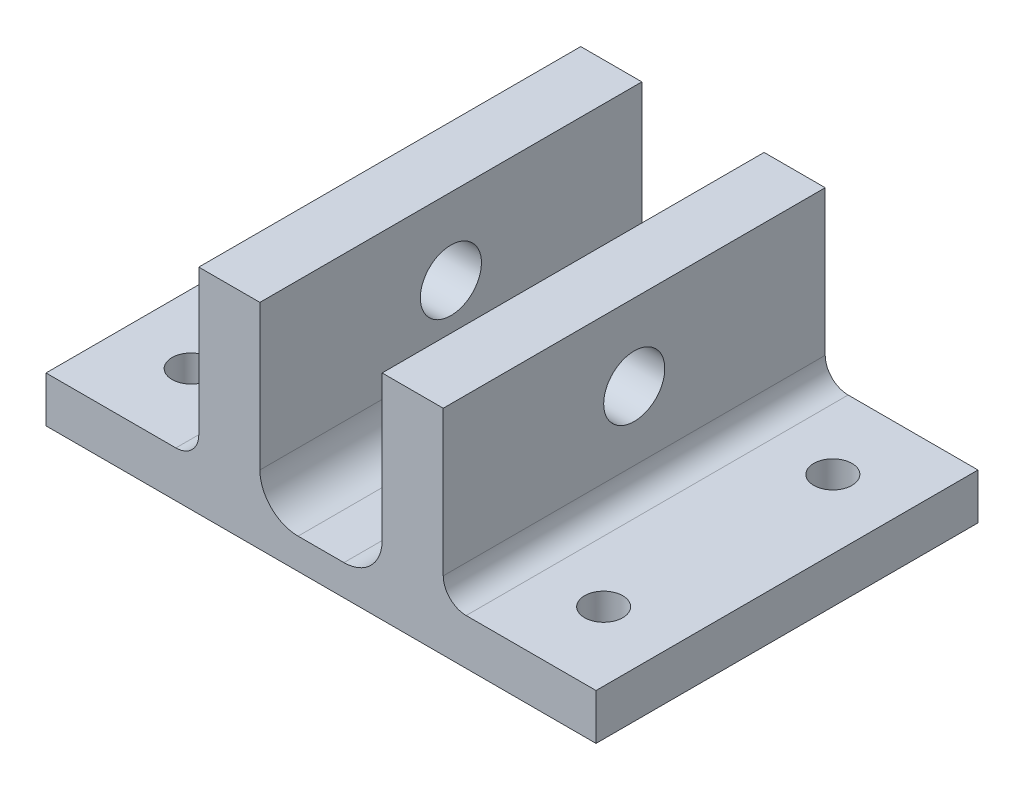
ISO-10303-21;
HEADER;
FILE_DESCRIPTION(('STEP AP214'),'2;1');
FILE_NAME('part.step','',(''),(''),'','','');
FILE_SCHEMA(('AUTOMOTIVE_DESIGN { 1 0 10303 214 1 1 1 1 }'));
ENDSEC;
DATA;
#1=APPLICATION_CONTEXT('core data for automotive mechanical design processes');
#2=APPLICATION_PROTOCOL_DEFINITION('international standard','automotive_design',2000,#1);
#3=PRODUCT_CONTEXT('',#1,'mechanical');
#4=PRODUCT('Part','Part','',(#3));
#5=PRODUCT_RELATED_PRODUCT_CATEGORY('part','',(#4));
#6=PRODUCT_DEFINITION_FORMATION('','',#4);
#7=PRODUCT_DEFINITION_CONTEXT('part definition',#1,'design');
#8=PRODUCT_DEFINITION('design','',#6,#7);
#9=PRODUCT_DEFINITION_SHAPE('','',#8);
#10=(LENGTH_UNIT() NAMED_UNIT(*) SI_UNIT(.MILLI.,.METRE.));
#11=(NAMED_UNIT(*) PLANE_ANGLE_UNIT() SI_UNIT($,.RADIAN.));
#12=(NAMED_UNIT(*) SI_UNIT($,.STERADIAN.) SOLID_ANGLE_UNIT());
#13=UNCERTAINTY_MEASURE_WITH_UNIT(LENGTH_MEASURE(1.E-05),#10,'distance_accuracy_value','');
#14=(GEOMETRIC_REPRESENTATION_CONTEXT(3) GLOBAL_UNCERTAINTY_ASSIGNED_CONTEXT((#13)) GLOBAL_UNIT_ASSIGNED_CONTEXT((#10,
#11,#12)) REPRESENTATION_CONTEXT('',''));
#15=CARTESIAN_POINT('',(0.,0.,0.));
#16=DIRECTION('',(0.,0.,1.));
#17=DIRECTION('',(1.,0.,0.));
#18=AXIS2_PLACEMENT_3D('',#15,#16,#17);
#19=CARTESIAN_POINT('',(-32.,0.,25.));
#20=DIRECTION('',(0.,1.,0.));
#21=DIRECTION('',(-1.,0.,0.));
#22=AXIS2_PLACEMENT_3D('',#19,#20,#21);
#23=PLANE('',#22);
#24=CARTESIAN_POINT('',(-43.,0.,15.));
#25=DIRECTION('',(0.,1.,0.));
#26=DIRECTION('',(1.,0.,0.));
#27=AXIS2_PLACEMENT_3D('',#24,#25,#26);
#28=CIRCLE('',#27,2.5);
#29=CARTESIAN_POINT('',(-40.5,0.,15.));
#30=VERTEX_POINT('',#29);
#31=EDGE_CURVE('E434',#30,#30,#28,.T.);
#32=ORIENTED_EDGE('',*,*,#31,.T.);
#33=EDGE_LOOP('',(#32));
#34=FACE_BOUND('',#33,.T.);
#35=CARTESIAN_POINT('',(11.,0.,15.));
#36=DIRECTION('',(0.,1.,0.));
#37=DIRECTION('',(-1.,0.,0.));
#38=AXIS2_PLACEMENT_3D('',#35,#36,#37);
#39=CIRCLE('',#38,2.5);
#40=CARTESIAN_POINT('',(8.50000000000001,0.,15.));
#41=VERTEX_POINT('',#40);
#42=EDGE_CURVE('E435',#41,#41,#39,.T.);
#43=ORIENTED_EDGE('',*,*,#42,.T.);
#44=EDGE_LOOP('',(#43));
#45=FACE_BOUND('',#44,.T.);
#46=CARTESIAN_POINT('',(11.,0.,-15.));
#47=DIRECTION('',(0.,1.,0.));
#48=DIRECTION('',(1.,0.,0.));
#49=AXIS2_PLACEMENT_3D('',#46,#47,#48);
#50=CIRCLE('',#49,2.5);
#51=CARTESIAN_POINT('',(13.5,0.,-15.));
#52=VERTEX_POINT('',#51);
#53=EDGE_CURVE('E438',#52,#52,#50,.T.);
#54=ORIENTED_EDGE('',*,*,#53,.T.);
#55=EDGE_LOOP('',(#54));
#56=FACE_BOUND('',#55,.T.);
#57=CARTESIAN_POINT('',(-43.,0.,-15.));
#58=DIRECTION('',(0.,1.,0.));
#59=DIRECTION('',(-1.,0.,0.));
#60=AXIS2_PLACEMENT_3D('',#57,#58,#59);
#61=CIRCLE('',#60,2.5);
#62=CARTESIAN_POINT('',(-45.5,0.,-15.));
#63=VERTEX_POINT('',#62);
#64=EDGE_CURVE('E287',#63,#63,#61,.T.);
#65=ORIENTED_EDGE('',*,*,#64,.T.);
#66=EDGE_LOOP('',(#65));
#67=FACE_BOUND('',#66,.T.);
#68=DIRECTION('',(1.,0.,0.));
#69=VECTOR('',#68,1.);
#70=CARTESIAN_POINT('',(-32.,0.,-25.));
#71=LINE('',#70,#69);
#72=CARTESIAN_POINT('',(-52.,0.,-25.));
#73=VERTEX_POINT('',#72);
#74=CARTESIAN_POINT('',(20.,0.,-25.));
#75=VERTEX_POINT('',#74);
#76=EDGE_CURVE('E176',#73,#75,#71,.T.);
#77=ORIENTED_EDGE('',*,*,#76,.T.);
#78=DIRECTION('',(0.,0.,-1.));
#79=VECTOR('',#78,1.);
#80=CARTESIAN_POINT('',(20.,0.,25.));
#81=LINE('',#80,#79);
#82=CARTESIAN_POINT('',(20.,0.,25.));
#83=VERTEX_POINT('',#82);
#84=EDGE_CURVE('E174',#83,#75,#81,.T.);
#85=ORIENTED_EDGE('',*,*,#84,.F.);
#86=DIRECTION('',(-1.,0.,0.));
#87=VECTOR('',#86,1.);
#88=CARTESIAN_POINT('',(-32.,0.,25.));
#89=LINE('',#88,#87);
#90=CARTESIAN_POINT('',(-52.,0.,25.));
#91=VERTEX_POINT('',#90);
#92=EDGE_CURVE('E168',#83,#91,#89,.T.);
#93=ORIENTED_EDGE('',*,*,#92,.T.);
#94=DIRECTION('',(0.,0.,-1.));
#95=VECTOR('',#94,1.);
#96=CARTESIAN_POINT('',(-52.,0.,25.));
#97=LINE('',#96,#95);
#98=EDGE_CURVE('E155',#91,#73,#97,.T.);
#99=ORIENTED_EDGE('',*,*,#98,.T.);
#100=EDGE_LOOP('',(#77,#85,#93,#99));
#101=FACE_BOUND('',#100,.T.);
#102=ADVANCED_FACE('F39',(#34,#45,#56,#67,#101),#23,.F.);
#103=CARTESIAN_POINT('',(20.,0.,25.));
#104=DIRECTION('',(-1.,0.,0.));
#105=DIRECTION('',(0.,0.,1.));
#106=AXIS2_PLACEMENT_3D('',#103,#104,#105);
#107=PLANE('',#106);
#108=DIRECTION('',(0.,1.,0.));
#109=VECTOR('',#108,1.);
#110=CARTESIAN_POINT('',(20.,0.,-25.));
#111=LINE('',#110,#109);
#112=CARTESIAN_POINT('',(20.,6.,-25.));
#113=VERTEX_POINT('',#112);
#114=EDGE_CURVE('E178',#75,#113,#111,.T.);
#115=ORIENTED_EDGE('',*,*,#114,.T.);
#116=DIRECTION('',(0.,0.,-1.));
#117=VECTOR('',#116,1.);
#118=CARTESIAN_POINT('',(20.,6.,25.));
#119=LINE('',#118,#117);
#120=CARTESIAN_POINT('',(20.,6.,25.));
#121=VERTEX_POINT('',#120);
#122=EDGE_CURVE('E233',#121,#113,#119,.T.);
#123=ORIENTED_EDGE('',*,*,#122,.F.);
#124=DIRECTION('',(0.,1.,0.));
#125=VECTOR('',#124,1.);
#126=CARTESIAN_POINT('',(20.,0.,25.));
#127=LINE('',#126,#125);
#128=EDGE_CURVE('E164',#83,#121,#127,.T.);
#129=ORIENTED_EDGE('',*,*,#128,.F.);
#130=ORIENTED_EDGE('',*,*,#84,.T.);
#131=EDGE_LOOP('',(#115,#123,#129,#130));
#132=FACE_BOUND('',#131,.T.);
#133=ADVANCED_FACE('F312',(#132),#107,.F.);
#134=CARTESIAN_POINT('',(20.,6.,25.));
#135=DIRECTION('',(0.,-1.,0.));
#136=DIRECTION('',(1.,0.,0.));
#137=AXIS2_PLACEMENT_3D('',#134,#135,#136);
#138=PLANE('',#137);
#139=CARTESIAN_POINT('',(11.,6.,15.));
#140=DIRECTION('',(0.,-1.,0.));
#141=DIRECTION('',(1.,0.,0.));
#142=AXIS2_PLACEMENT_3D('',#139,#140,#141);
#143=CIRCLE('',#142,2.5);
#144=CARTESIAN_POINT('',(13.5,6.,15.));
#145=VERTEX_POINT('',#144);
#146=EDGE_CURVE('E43',#145,#145,#143,.T.);
#147=ORIENTED_EDGE('',*,*,#146,.T.);
#148=EDGE_LOOP('',(#147));
#149=FACE_BOUND('',#148,.T.);
#150=CARTESIAN_POINT('',(11.,6.,-15.));
#151=DIRECTION('',(0.,-1.,0.));
#152=DIRECTION('',(1.,0.,0.));
#153=AXIS2_PLACEMENT_3D('',#150,#151,#152);
#154=CIRCLE('',#153,2.5);
#155=CARTESIAN_POINT('',(13.5,6.,-15.));
#156=VERTEX_POINT('',#155);
#157=EDGE_CURVE('E289',#156,#156,#154,.T.);
#158=ORIENTED_EDGE('',*,*,#157,.T.);
#159=EDGE_LOOP('',(#158));
#160=FACE_BOUND('',#159,.T.);
#161=DIRECTION('',(-1.,0.,0.));
#162=VECTOR('',#161,1.);
#163=CARTESIAN_POINT('',(20.,6.,-25.));
#164=LINE('',#163,#162);
#165=CARTESIAN_POINT('',(3.,5.99999999999999,-25.));
#166=VERTEX_POINT('',#165);
#167=EDGE_CURVE('E227',#113,#166,#164,.T.);
#168=ORIENTED_EDGE('',*,*,#167,.T.);
#169=DIRECTION('',(0.,0.,-1.));
#170=VECTOR('',#169,1.);
#171=CARTESIAN_POINT('',(3.,5.99999999999999,25.));
#172=LINE('',#171,#170);
#173=CARTESIAN_POINT('',(3.,5.99999999999999,25.));
#174=VERTEX_POINT('',#173);
#175=EDGE_CURVE('E254',#166,#174,#172,.F.);
#176=ORIENTED_EDGE('',*,*,#175,.T.);
#177=DIRECTION('',(-1.,0.,0.));
#178=VECTOR('',#177,1.);
#179=CARTESIAN_POINT('',(20.,6.,25.));
#180=LINE('',#179,#178);
#181=EDGE_CURVE('E201',#121,#174,#180,.T.);
#182=ORIENTED_EDGE('',*,*,#181,.F.);
#183=ORIENTED_EDGE('',*,*,#122,.T.);
#184=EDGE_LOOP('',(#168,#176,#182,#183));
#185=FACE_BOUND('',#184,.T.);
#186=ADVANCED_FACE('F296',(#149,#160,#185),#138,.F.);
#187=CARTESIAN_POINT('',(0.,5.99999999999999,25.));
#188=DIRECTION('',(-1.,0.,0.));
#189=DIRECTION('',(0.,0.,1.));
#190=AXIS2_PLACEMENT_3D('',#187,#188,#189);
#191=PLANE('',#190);
#192=CARTESIAN_POINT('',(0.,18.,0.));
#193=DIRECTION('',(-1.,0.,0.));
#194=DIRECTION('',(0.,0.,1.));
#195=AXIS2_PLACEMENT_3D('',#192,#193,#194);
#196=CIRCLE('',#195,4.);
#197=CARTESIAN_POINT('',(0.,18.,4.));
#198=VERTEX_POINT('',#197);
#199=EDGE_CURVE('E181',#198,#198,#196,.T.);
#200=ORIENTED_EDGE('',*,*,#199,.T.);
#201=EDGE_LOOP('',(#200));
#202=FACE_BOUND('',#201,.T.);
#203=DIRECTION('',(0.,1.,0.));
#204=VECTOR('',#203,1.);
#205=CARTESIAN_POINT('',(0.,5.99999999999999,25.));
#206=LINE('',#205,#204);
#207=CARTESIAN_POINT('',(0.,9.,25.));
#208=VERTEX_POINT('',#207);
#209=CARTESIAN_POINT('',(0.,28.,25.));
#210=VERTEX_POINT('',#209);
#211=EDGE_CURVE('E199',#208,#210,#206,.T.);
#212=ORIENTED_EDGE('',*,*,#211,.F.);
#213=DIRECTION('',(0.,0.,-1.));
#214=VECTOR('',#213,1.);
#215=CARTESIAN_POINT('',(0.,9.,-25.));
#216=LINE('',#215,#214);
#217=CARTESIAN_POINT('',(0.,9.,-25.));
#218=VERTEX_POINT('',#217);
#219=EDGE_CURVE('E232',#208,#218,#216,.T.);
#220=ORIENTED_EDGE('',*,*,#219,.T.);
#221=DIRECTION('',(0.,1.,0.));
#222=VECTOR('',#221,1.);
#223=CARTESIAN_POINT('',(0.,5.99999999999999,-25.));
#224=LINE('',#223,#222);
#225=CARTESIAN_POINT('',(0.,28.,-25.));
#226=VERTEX_POINT('',#225);
#227=EDGE_CURVE('E225',#218,#226,#224,.T.);
#228=ORIENTED_EDGE('',*,*,#227,.T.);
#229=DIRECTION('',(0.,0.,-1.));
#230=VECTOR('',#229,1.);
#231=CARTESIAN_POINT('',(0.,28.,25.));
#232=LINE('',#231,#230);
#233=EDGE_CURVE('E236',#210,#226,#232,.T.);
#234=ORIENTED_EDGE('',*,*,#233,.F.);
#235=EDGE_LOOP('',(#212,#220,#228,#234));
#236=FACE_BOUND('',#235,.T.);
#237=ADVANCED_FACE('F328',(#202,#236),#191,.F.);
#238=CARTESIAN_POINT('',(0.,28.,25.));
#239=DIRECTION('',(0.,-1.,0.));
#240=DIRECTION('',(1.,0.,0.));
#241=AXIS2_PLACEMENT_3D('',#238,#239,#240);
#242=PLANE('',#241);
#243=DIRECTION('',(-1.,0.,0.));
#244=VECTOR('',#243,1.);
#245=CARTESIAN_POINT('',(0.,28.,-25.));
#246=LINE('',#245,#244);
#247=CARTESIAN_POINT('',(-8.,28.,-25.));
#248=VERTEX_POINT('',#247);
#249=EDGE_CURVE('E223',#226,#248,#246,.T.);
#250=ORIENTED_EDGE('',*,*,#249,.T.);
#251=DIRECTION('',(0.,0.,-1.));
#252=VECTOR('',#251,1.);
#253=CARTESIAN_POINT('',(-8.,28.,25.));
#254=LINE('',#253,#252);
#255=CARTESIAN_POINT('',(-8.,28.,25.));
#256=VERTEX_POINT('',#255);
#257=EDGE_CURVE('E239',#256,#248,#254,.T.);
#258=ORIENTED_EDGE('',*,*,#257,.F.);
#259=DIRECTION('',(-1.,0.,0.));
#260=VECTOR('',#259,1.);
#261=CARTESIAN_POINT('',(0.,28.,25.));
#262=LINE('',#261,#260);
#263=EDGE_CURVE('E197',#210,#256,#262,.T.);
#264=ORIENTED_EDGE('',*,*,#263,.F.);
#265=ORIENTED_EDGE('',*,*,#233,.T.);
#266=EDGE_LOOP('',(#250,#258,#264,#265));
#267=FACE_BOUND('',#266,.T.);
#268=ADVANCED_FACE('F331',(#267),#242,.F.);
#269=CARTESIAN_POINT('',(-8.,28.,25.));
#270=DIRECTION('',(1.,0.,0.));
#271=DIRECTION('',(0.,1.,0.));
#272=AXIS2_PLACEMENT_3D('',#269,#270,#271);
#273=PLANE('',#272);
#274=CARTESIAN_POINT('',(-8.,18.,0.));
#275=DIRECTION('',(1.,0.,0.));
#276=DIRECTION('',(0.,1.,0.));
#277=AXIS2_PLACEMENT_3D('',#274,#275,#276);
#278=CIRCLE('',#277,4.);
#279=CARTESIAN_POINT('',(-8.,22.,0.));
#280=VERTEX_POINT('',#279);
#281=EDGE_CURVE('E445',#280,#280,#278,.T.);
#282=ORIENTED_EDGE('',*,*,#281,.T.);
#283=EDGE_LOOP('',(#282));
#284=FACE_BOUND('',#283,.T.);
#285=DIRECTION('',(0.,-1.,0.));
#286=VECTOR('',#285,1.);
#287=CARTESIAN_POINT('',(-8.,28.,-25.));
#288=LINE('',#287,#286);
#289=CARTESIAN_POINT('',(-8.,9.,-25.));
#290=VERTEX_POINT('',#289);
#291=EDGE_CURVE('E220',#248,#290,#288,.T.);
#292=ORIENTED_EDGE('',*,*,#291,.T.);
#293=DIRECTION('',(0.,0.,-1.));
#294=VECTOR('',#293,1.);
#295=CARTESIAN_POINT('',(-8.,9.,25.));
#296=LINE('',#295,#294);
#297=CARTESIAN_POINT('',(-8.,9.,25.));
#298=VERTEX_POINT('',#297);
#299=EDGE_CURVE('E274',#290,#298,#296,.F.);
#300=ORIENTED_EDGE('',*,*,#299,.T.);
#301=DIRECTION('',(0.,-1.,0.));
#302=VECTOR('',#301,1.);
#303=CARTESIAN_POINT('',(-8.,28.,25.));
#304=LINE('',#303,#302);
#305=EDGE_CURVE('E194',#256,#298,#304,.T.);
#306=ORIENTED_EDGE('',*,*,#305,.F.);
#307=ORIENTED_EDGE('',*,*,#257,.T.);
#308=EDGE_LOOP('',(#292,#300,#306,#307));
#309=FACE_BOUND('',#308,.T.);
#310=ADVANCED_FACE('F335',(#284,#309),#273,.F.);
#311=CARTESIAN_POINT('',(-8.,4.,25.));
#312=DIRECTION('',(0.,-1.,0.));
#313=DIRECTION('',(1.,0.,0.));
#314=AXIS2_PLACEMENT_3D('',#311,#312,#313);
#315=PLANE('',#314);
#316=DIRECTION('',(-1.,0.,0.));
#317=VECTOR('',#316,1.);
#318=CARTESIAN_POINT('',(-8.,4.,25.));
#319=LINE('',#318,#317);
#320=CARTESIAN_POINT('',(-13.,4.,25.));
#321=VERTEX_POINT('',#320);
#322=CARTESIAN_POINT('',(-19.,4.,25.));
#323=VERTEX_POINT('',#322);
#324=EDGE_CURVE('E192',#321,#323,#319,.T.);
#325=ORIENTED_EDGE('',*,*,#324,.F.);
#326=DIRECTION('',(0.,0.,-1.));
#327=VECTOR('',#326,1.);
#328=CARTESIAN_POINT('',(-13.,4.,-25.));
#329=LINE('',#328,#327);
#330=CARTESIAN_POINT('',(-13.,4.,-25.));
#331=VERTEX_POINT('',#330);
#332=EDGE_CURVE('E271',#321,#331,#329,.T.);
#333=ORIENTED_EDGE('',*,*,#332,.T.);
#334=DIRECTION('',(-1.,0.,0.));
#335=VECTOR('',#334,1.);
#336=CARTESIAN_POINT('',(-8.,4.,-25.));
#337=LINE('',#336,#335);
#338=CARTESIAN_POINT('',(-19.,4.,-25.));
#339=VERTEX_POINT('',#338);
#340=EDGE_CURVE('E217',#331,#339,#337,.T.);
#341=ORIENTED_EDGE('',*,*,#340,.T.);
#342=DIRECTION('',(0.,0.,-1.));
#343=VECTOR('',#342,1.);
#344=CARTESIAN_POINT('',(-19.,4.,25.));
#345=LINE('',#344,#343);
#346=EDGE_CURVE('E269',#339,#323,#345,.F.);
#347=ORIENTED_EDGE('',*,*,#346,.T.);
#348=EDGE_LOOP('',(#325,#333,#341,#347));
#349=FACE_BOUND('',#348,.T.);
#350=ADVANCED_FACE('F339',(#349),#315,.F.);
#351=CARTESIAN_POINT('',(-24.,28.,25.));
#352=DIRECTION('',(1.,0.,0.));
#353=DIRECTION('',(0.,1.,0.));
#354=AXIS2_PLACEMENT_3D('',#351,#352,#353);
#355=PLANE('',#354);
#356=CARTESIAN_POINT('',(-24.,18.,0.));
#357=DIRECTION('',(1.,0.,0.));
#358=DIRECTION('',(0.,1.,0.));
#359=AXIS2_PLACEMENT_3D('',#356,#357,#358);
#360=CIRCLE('',#359,4.);
#361=CARTESIAN_POINT('',(-24.,22.,0.));
#362=VERTEX_POINT('',#361);
#363=EDGE_CURVE('E251',#362,#362,#360,.T.);
#364=ORIENTED_EDGE('',*,*,#363,.F.);
#365=EDGE_LOOP('',(#364));
#366=FACE_BOUND('',#365,.T.);
#367=DIRECTION('',(0.,-1.,0.));
#368=VECTOR('',#367,1.);
#369=CARTESIAN_POINT('',(-24.,28.,25.));
#370=LINE('',#369,#368);
#371=CARTESIAN_POINT('',(-24.,28.,25.));
#372=VERTEX_POINT('',#371);
#373=CARTESIAN_POINT('',(-24.,9.,25.));
#374=VERTEX_POINT('',#373);
#375=EDGE_CURVE('E190',#372,#374,#370,.T.);
#376=ORIENTED_EDGE('',*,*,#375,.T.);
#377=DIRECTION('',(0.,0.,-1.));
#378=VECTOR('',#377,1.);
#379=CARTESIAN_POINT('',(-24.,9.,25.));
#380=LINE('',#379,#378);
#381=CARTESIAN_POINT('',(-24.,9.,-25.));
#382=VERTEX_POINT('',#381);
#383=EDGE_CURVE('E276',#374,#382,#380,.T.);
#384=ORIENTED_EDGE('',*,*,#383,.T.);
#385=DIRECTION('',(0.,-1.,0.));
#386=VECTOR('',#385,1.);
#387=CARTESIAN_POINT('',(-24.,28.,-25.));
#388=LINE('',#387,#386);
#389=CARTESIAN_POINT('',(-24.,28.,-25.));
#390=VERTEX_POINT('',#389);
#391=EDGE_CURVE('E214',#390,#382,#388,.T.);
#392=ORIENTED_EDGE('',*,*,#391,.F.);
#393=DIRECTION('',(0.,0.,-1.));
#394=VECTOR('',#393,1.);
#395=CARTESIAN_POINT('',(-24.,28.,25.));
#396=LINE('',#395,#394);
#397=EDGE_CURVE('E242',#372,#390,#396,.T.);
#398=ORIENTED_EDGE('',*,*,#397,.F.);
#399=EDGE_LOOP('',(#376,#384,#392,#398));
#400=FACE_BOUND('',#399,.T.);
#401=ADVANCED_FACE('F343',(#366,#400),#355,.T.);
#402=CARTESIAN_POINT('',(-32.,28.,25.));
#403=DIRECTION('',(0.,1.,0.));
#404=DIRECTION('',(0.,0.,1.));
#405=AXIS2_PLACEMENT_3D('',#402,#403,#404);
#406=PLANE('',#405);
#407=DIRECTION('',(1.,0.,0.));
#408=VECTOR('',#407,1.);
#409=CARTESIAN_POINT('',(-32.,28.,-25.));
#410=LINE('',#409,#408);
#411=CARTESIAN_POINT('',(-32.,28.,-25.));
#412=VERTEX_POINT('',#411);
#413=EDGE_CURVE('E211',#412,#390,#410,.T.);
#414=ORIENTED_EDGE('',*,*,#413,.F.);
#415=DIRECTION('',(0.,0.,-1.));
#416=VECTOR('',#415,1.);
#417=CARTESIAN_POINT('',(-32.,28.,25.));
#418=LINE('',#417,#416);
#419=CARTESIAN_POINT('',(-32.,28.,25.));
#420=VERTEX_POINT('',#419);
#421=EDGE_CURVE('E244',#420,#412,#418,.T.);
#422=ORIENTED_EDGE('',*,*,#421,.F.);
#423=DIRECTION('',(1.,0.,0.));
#424=VECTOR('',#423,1.);
#425=CARTESIAN_POINT('',(-32.,28.,25.));
#426=LINE('',#425,#424);
#427=EDGE_CURVE('E187',#420,#372,#426,.T.);
#428=ORIENTED_EDGE('',*,*,#427,.T.);
#429=ORIENTED_EDGE('',*,*,#397,.T.);
#430=EDGE_LOOP('',(#414,#422,#428,#429));
#431=FACE_BOUND('',#430,.T.);
#432=ADVANCED_FACE('F347',(#431),#406,.T.);
#433=CARTESIAN_POINT('',(-32.,6.,25.));
#434=DIRECTION('',(-1.,0.,0.));
#435=DIRECTION('',(0.,0.,1.));
#436=AXIS2_PLACEMENT_3D('',#433,#434,#435);
#437=PLANE('',#436);
#438=CARTESIAN_POINT('',(-32.,18.,0.));
#439=DIRECTION('',(-1.,0.,0.));
#440=DIRECTION('',(0.,0.,1.));
#441=AXIS2_PLACEMENT_3D('',#438,#439,#440);
#442=CIRCLE('',#441,4.);
#443=CARTESIAN_POINT('',(-32.,18.,4.));
#444=VERTEX_POINT('',#443);
#445=EDGE_CURVE('E248',#444,#444,#442,.T.);
#446=ORIENTED_EDGE('',*,*,#445,.F.);
#447=EDGE_LOOP('',(#446));
#448=FACE_BOUND('',#447,.T.);
#449=DIRECTION('',(0.,1.,0.));
#450=VECTOR('',#449,1.);
#451=CARTESIAN_POINT('',(-32.,6.,-25.));
#452=LINE('',#451,#450);
#453=CARTESIAN_POINT('',(-32.,9.,-25.));
#454=VERTEX_POINT('',#453);
#455=EDGE_CURVE('E209',#454,#412,#452,.T.);
#456=ORIENTED_EDGE('',*,*,#455,.F.);
#457=DIRECTION('',(0.,0.,-1.));
#458=VECTOR('',#457,1.);
#459=CARTESIAN_POINT('',(-32.,9.,25.));
#460=LINE('',#459,#458);
#461=CARTESIAN_POINT('',(-32.,9.,25.));
#462=VERTEX_POINT('',#461);
#463=EDGE_CURVE('E259',#454,#462,#460,.F.);
#464=ORIENTED_EDGE('',*,*,#463,.T.);
#465=DIRECTION('',(0.,1.,0.));
#466=VECTOR('',#465,1.);
#467=CARTESIAN_POINT('',(-32.,6.,25.));
#468=LINE('',#467,#466);
#469=EDGE_CURVE('E185',#462,#420,#468,.T.);
#470=ORIENTED_EDGE('',*,*,#469,.T.);
#471=ORIENTED_EDGE('',*,*,#421,.T.);
#472=EDGE_LOOP('',(#456,#464,#470,#471));
#473=FACE_BOUND('',#472,.T.);
#474=ADVANCED_FACE('F351',(#448,#473),#437,.T.);
#475=CARTESIAN_POINT('',(-52.,6.,25.));
#476=DIRECTION('',(0.,1.,0.));
#477=DIRECTION('',(0.,0.,1.));
#478=AXIS2_PLACEMENT_3D('',#475,#476,#477);
#479=PLANE('',#478);
#480=CARTESIAN_POINT('',(-43.,6.,15.));
#481=DIRECTION('',(0.,1.,0.));
#482=DIRECTION('',(0.,0.,1.));
#483=AXIS2_PLACEMENT_3D('',#480,#481,#482);
#484=CIRCLE('',#483,2.5);
#485=CARTESIAN_POINT('',(-43.,6.,17.5));
#486=VERTEX_POINT('',#485);
#487=EDGE_CURVE('E286',#486,#486,#484,.T.);
#488=ORIENTED_EDGE('',*,*,#487,.F.);
#489=EDGE_LOOP('',(#488));
#490=FACE_BOUND('',#489,.T.);
#491=CARTESIAN_POINT('',(-43.,6.,-15.));
#492=DIRECTION('',(0.,1.,0.));
#493=DIRECTION('',(0.,0.,1.));
#494=AXIS2_PLACEMENT_3D('',#491,#492,#493);
#495=CIRCLE('',#494,2.5);
#496=CARTESIAN_POINT('',(-43.,6.,-12.5));
#497=VERTEX_POINT('',#496);
#498=EDGE_CURVE('E283',#497,#497,#495,.T.);
#499=ORIENTED_EDGE('',*,*,#498,.F.);
#500=EDGE_LOOP('',(#499));
#501=FACE_BOUND('',#500,.T.);
#502=DIRECTION('',(1.,0.,0.));
#503=VECTOR('',#502,1.);
#504=CARTESIAN_POINT('',(-52.,6.,25.));
#505=LINE('',#504,#503);
#506=CARTESIAN_POINT('',(-52.,6.,25.));
#507=VERTEX_POINT('',#506);
#508=CARTESIAN_POINT('',(-35.,6.,25.));
#509=VERTEX_POINT('',#508);
#510=EDGE_CURVE('E171',#507,#509,#505,.T.);
#511=ORIENTED_EDGE('',*,*,#510,.T.);
#512=DIRECTION('',(0.,0.,-1.));
#513=VECTOR('',#512,1.);
#514=CARTESIAN_POINT('',(-35.,6.,-25.));
#515=LINE('',#514,#513);
#516=CARTESIAN_POINT('',(-35.,6.,-25.));
#517=VERTEX_POINT('',#516);
#518=EDGE_CURVE('E256',#509,#517,#515,.T.);
#519=ORIENTED_EDGE('',*,*,#518,.T.);
#520=DIRECTION('',(1.,0.,0.));
#521=VECTOR('',#520,1.);
#522=CARTESIAN_POINT('',(-52.,6.,-25.));
#523=LINE('',#522,#521);
#524=CARTESIAN_POINT('',(-52.,6.,-25.));
#525=VERTEX_POINT('',#524);
#526=EDGE_CURVE('E206',#525,#517,#523,.T.);
#527=ORIENTED_EDGE('',*,*,#526,.F.);
#528=DIRECTION('',(0.,0.,-1.));
#529=VECTOR('',#528,1.);
#530=CARTESIAN_POINT('',(-52.,6.,25.));
#531=LINE('',#530,#529);
#532=EDGE_CURVE('E163',#507,#525,#531,.T.);
#533=ORIENTED_EDGE('',*,*,#532,.F.);
#534=EDGE_LOOP('',(#511,#519,#527,#533));
#535=FACE_BOUND('',#534,.T.);
#536=ADVANCED_FACE('F355',(#490,#501,#535),#479,.T.);
#537=CARTESIAN_POINT('',(-52.,0.,25.));
#538=DIRECTION('',(-1.,0.,0.));
#539=DIRECTION('',(0.,0.,1.));
#540=AXIS2_PLACEMENT_3D('',#537,#538,#539);
#541=PLANE('',#540);
#542=DIRECTION('',(0.,1.,0.));
#543=VECTOR('',#542,1.);
#544=CARTESIAN_POINT('',(-52.,0.,-25.));
#545=LINE('',#544,#543);
#546=EDGE_CURVE('E160',#73,#525,#545,.T.);
#547=ORIENTED_EDGE('',*,*,#546,.F.);
#548=ORIENTED_EDGE('',*,*,#98,.F.);
#549=DIRECTION('',(0.,1.,0.));
#550=VECTOR('',#549,1.);
#551=CARTESIAN_POINT('',(-52.,0.,25.));
#552=LINE('',#551,#550);
#553=EDGE_CURVE('E158',#91,#507,#552,.T.);
#554=ORIENTED_EDGE('',*,*,#553,.T.);
#555=ORIENTED_EDGE('',*,*,#532,.T.);
#556=EDGE_LOOP('',(#547,#548,#554,#555));
#557=FACE_BOUND('',#556,.T.);
#558=ADVANCED_FACE('F157',(#557),#541,.T.);
#559=CARTESIAN_POINT('',(0.,0.,25.));
#560=DIRECTION('',(0.,0.,-1.));
#561=DIRECTION('',(-1.,0.,0.));
#562=AXIS2_PLACEMENT_3D('',#559,#560,#561);
#563=PLANE('',#562);
#564=ORIENTED_EDGE('',*,*,#92,.F.);
#565=ORIENTED_EDGE('',*,*,#128,.T.);
#566=ORIENTED_EDGE('',*,*,#181,.T.);
#567=CARTESIAN_POINT('',(3.,9.,25.));
#568=DIRECTION('',(0.,0.,-1.));
#569=DIRECTION('',(-1.,0.,0.));
#570=AXIS2_PLACEMENT_3D('',#567,#568,#569);
#571=CIRCLE('',#570,3.);
#572=EDGE_CURVE('E263',#174,#208,#571,.T.);
#573=ORIENTED_EDGE('',*,*,#572,.T.);
#574=ORIENTED_EDGE('',*,*,#211,.T.);
#575=ORIENTED_EDGE('',*,*,#263,.T.);
#576=ORIENTED_EDGE('',*,*,#305,.T.);
#577=CARTESIAN_POINT('',(-13.,9.,25.));
#578=DIRECTION('',(0.,0.,-1.));
#579=DIRECTION('',(-1.,0.,0.));
#580=AXIS2_PLACEMENT_3D('',#577,#578,#579);
#581=CIRCLE('',#580,5.);
#582=EDGE_CURVE('E280',#298,#321,#581,.T.);
#583=ORIENTED_EDGE('',*,*,#582,.T.);
#584=ORIENTED_EDGE('',*,*,#324,.T.);
#585=CARTESIAN_POINT('',(-19.,9.,25.));
#586=DIRECTION('',(0.,0.,-1.));
#587=DIRECTION('',(-1.,0.,0.));
#588=AXIS2_PLACEMENT_3D('',#585,#586,#587);
#589=CIRCLE('',#588,5.);
#590=EDGE_CURVE('E11',#323,#374,#589,.T.);
#591=ORIENTED_EDGE('',*,*,#590,.T.);
#592=ORIENTED_EDGE('',*,*,#375,.F.);
#593=ORIENTED_EDGE('',*,*,#427,.F.);
#594=ORIENTED_EDGE('',*,*,#469,.F.);
#595=CARTESIAN_POINT('',(-35.,9.,25.));
#596=DIRECTION('',(0.,0.,-1.));
#597=DIRECTION('',(-1.,0.,0.));
#598=AXIS2_PLACEMENT_3D('',#595,#596,#597);
#599=CIRCLE('',#598,3.);
#600=EDGE_CURVE('E267',#462,#509,#599,.T.);
#601=ORIENTED_EDGE('',*,*,#600,.T.);
#602=ORIENTED_EDGE('',*,*,#510,.F.);
#603=ORIENTED_EDGE('',*,*,#553,.F.);
#604=EDGE_LOOP('',(#564,#565,#566,#573,#574,#575,#576,#583,#584,#591,#592,#593,#594,#601,#602,#603));
#605=FACE_BOUND('',#604,.T.);
#606=ADVANCED_FACE('F167',(#605),#563,.F.);
#607=CARTESIAN_POINT('',(0.,0.,-25.));
#608=DIRECTION('',(0.,0.,-1.));
#609=DIRECTION('',(-1.,0.,0.));
#610=AXIS2_PLACEMENT_3D('',#607,#608,#609);
#611=PLANE('',#610);
#612=ORIENTED_EDGE('',*,*,#76,.F.);
#613=ORIENTED_EDGE('',*,*,#546,.T.);
#614=ORIENTED_EDGE('',*,*,#526,.T.);
#615=CARTESIAN_POINT('',(-35.,9.,-25.));
#616=DIRECTION('',(0.,0.,-1.));
#617=DIRECTION('',(-1.,0.,0.));
#618=AXIS2_PLACEMENT_3D('',#615,#616,#617);
#619=CIRCLE('',#618,3.);
#620=EDGE_CURVE('E265',#517,#454,#619,.F.);
#621=ORIENTED_EDGE('',*,*,#620,.T.);
#622=ORIENTED_EDGE('',*,*,#455,.T.);
#623=ORIENTED_EDGE('',*,*,#413,.T.);
#624=ORIENTED_EDGE('',*,*,#391,.T.);
#625=CARTESIAN_POINT('',(-19.,9.,-25.));
#626=DIRECTION('',(0.,0.,-1.));
#627=DIRECTION('',(-1.,0.,0.));
#628=AXIS2_PLACEMENT_3D('',#625,#626,#627);
#629=CIRCLE('',#628,5.);
#630=EDGE_CURVE('E48',#382,#339,#629,.F.);
#631=ORIENTED_EDGE('',*,*,#630,.T.);
#632=ORIENTED_EDGE('',*,*,#340,.F.);
#633=CARTESIAN_POINT('',(-13.,9.,-25.));
#634=DIRECTION('',(0.,0.,-1.));
#635=DIRECTION('',(-1.,0.,0.));
#636=AXIS2_PLACEMENT_3D('',#633,#634,#635);
#637=CIRCLE('',#636,5.);
#638=EDGE_CURVE('E278',#331,#290,#637,.F.);
#639=ORIENTED_EDGE('',*,*,#638,.T.);
#640=ORIENTED_EDGE('',*,*,#291,.F.);
#641=ORIENTED_EDGE('',*,*,#249,.F.);
#642=ORIENTED_EDGE('',*,*,#227,.F.);
#643=CARTESIAN_POINT('',(3.,9.,-25.));
#644=DIRECTION('',(0.,0.,-1.));
#645=DIRECTION('',(-1.,0.,0.));
#646=AXIS2_PLACEMENT_3D('',#643,#644,#645);
#647=CIRCLE('',#646,3.);
#648=EDGE_CURVE('E261',#218,#166,#647,.F.);
#649=ORIENTED_EDGE('',*,*,#648,.T.);
#650=ORIENTED_EDGE('',*,*,#167,.F.);
#651=ORIENTED_EDGE('',*,*,#114,.F.);
#652=EDGE_LOOP('',(#612,#613,#614,#621,#622,#623,#624,#631,#632,#639,#640,#641,#642,#649,#650,#651));
#653=FACE_BOUND('',#652,.T.);
#654=ADVANCED_FACE('F323',(#653),#611,.T.);
#655=CARTESIAN_POINT('',(20.,18.,0.));
#656=DIRECTION('',(-1.,0.,0.));
#657=DIRECTION('',(0.,-1.,0.));
#658=AXIS2_PLACEMENT_3D('',#655,#656,#657);
#659=CYLINDRICAL_SURFACE('',#658,4.);
#660=ORIENTED_EDGE('',*,*,#363,.T.);
#661=EDGE_LOOP('',(#660));
#662=FACE_BOUND('',#661,.T.);
#663=ORIENTED_EDGE('',*,*,#445,.T.);
#664=EDGE_LOOP('',(#663));
#665=FACE_BOUND('',#664,.T.);
#666=ADVANCED_FACE('F415',(#662,#665),#659,.F.);
#667=ORIENTED_EDGE('',*,*,#281,.F.);
#668=EDGE_LOOP('',(#667));
#669=FACE_BOUND('',#668,.T.);
#670=ORIENTED_EDGE('',*,*,#199,.F.);
#671=EDGE_LOOP('',(#670));
#672=FACE_BOUND('',#671,.T.);
#673=ADVANCED_FACE('F366',(#669,#672),#659,.F.);
#674=CARTESIAN_POINT('',(3.,9.,25.));
#675=DIRECTION('',(0.,0.,1.));
#676=DIRECTION('',(1.,0.,0.));
#677=AXIS2_PLACEMENT_3D('',#674,#675,#676);
#678=CYLINDRICAL_SURFACE('',#677,3.);
#679=ORIENTED_EDGE('',*,*,#572,.F.);
#680=ORIENTED_EDGE('',*,*,#175,.F.);
#681=ORIENTED_EDGE('',*,*,#648,.F.);
#682=ORIENTED_EDGE('',*,*,#219,.F.);
#683=EDGE_LOOP('',(#679,#680,#681,#682));
#684=FACE_BOUND('',#683,.T.);
#685=ADVANCED_FACE('F362',(#684),#678,.F.);
#686=CARTESIAN_POINT('',(-35.,9.,25.));
#687=DIRECTION('',(0.,0.,1.));
#688=DIRECTION('',(1.,0.,0.));
#689=AXIS2_PLACEMENT_3D('',#686,#687,#688);
#690=CYLINDRICAL_SURFACE('',#689,3.);
#691=ORIENTED_EDGE('',*,*,#600,.F.);
#692=ORIENTED_EDGE('',*,*,#463,.F.);
#693=ORIENTED_EDGE('',*,*,#620,.F.);
#694=ORIENTED_EDGE('',*,*,#518,.F.);
#695=EDGE_LOOP('',(#691,#692,#693,#694));
#696=FACE_BOUND('',#695,.T.);
#697=ADVANCED_FACE('F365',(#696),#690,.F.);
#698=CARTESIAN_POINT('',(-13.,9.,25.));
#699=DIRECTION('',(0.,0.,1.));
#700=DIRECTION('',(1.,0.,0.));
#701=AXIS2_PLACEMENT_3D('',#698,#699,#700);
#702=CYLINDRICAL_SURFACE('',#701,5.);
#703=ORIENTED_EDGE('',*,*,#582,.F.);
#704=ORIENTED_EDGE('',*,*,#299,.F.);
#705=ORIENTED_EDGE('',*,*,#638,.F.);
#706=ORIENTED_EDGE('',*,*,#332,.F.);
#707=EDGE_LOOP('',(#703,#704,#705,#706));
#708=FACE_BOUND('',#707,.T.);
#709=ADVANCED_FACE('F369',(#708),#702,.F.);
#710=CARTESIAN_POINT('',(-19.,9.,25.));
#711=DIRECTION('',(0.,0.,-1.));
#712=DIRECTION('',(-1.,0.,0.));
#713=AXIS2_PLACEMENT_3D('',#710,#711,#712);
#714=CYLINDRICAL_SURFACE('',#713,5.);
#715=ORIENTED_EDGE('',*,*,#590,.F.);
#716=ORIENTED_EDGE('',*,*,#346,.F.);
#717=ORIENTED_EDGE('',*,*,#630,.F.);
#718=ORIENTED_EDGE('',*,*,#383,.F.);
#719=EDGE_LOOP('',(#715,#716,#717,#718));
#720=FACE_BOUND('',#719,.T.);
#721=ADVANCED_FACE('F41',(#720),#714,.F.);
#722=CARTESIAN_POINT('',(-43.,0.,-15.));
#723=DIRECTION('',(0.,1.,0.));
#724=DIRECTION('',(-1.,0.,0.));
#725=AXIS2_PLACEMENT_3D('',#722,#723,#724);
#726=CYLINDRICAL_SURFACE('',#725,2.5);
#727=ORIENTED_EDGE('',*,*,#498,.T.);
#728=EDGE_LOOP('',(#727));
#729=FACE_BOUND('',#728,.T.);
#730=ORIENTED_EDGE('',*,*,#64,.F.);
#731=EDGE_LOOP('',(#730));
#732=FACE_BOUND('',#731,.T.);
#733=ADVANCED_FACE('F376',(#729,#732),#726,.F.);
#734=CARTESIAN_POINT('',(-43.,0.,15.));
#735=DIRECTION('',(0.,1.,0.));
#736=DIRECTION('',(-1.,0.,0.));
#737=AXIS2_PLACEMENT_3D('',#734,#735,#736);
#738=CYLINDRICAL_SURFACE('',#737,2.5);
#739=ORIENTED_EDGE('',*,*,#487,.T.);
#740=EDGE_LOOP('',(#739));
#741=FACE_BOUND('',#740,.T.);
#742=ORIENTED_EDGE('',*,*,#31,.F.);
#743=EDGE_LOOP('',(#742));
#744=FACE_BOUND('',#743,.T.);
#745=ADVANCED_FACE('F306',(#741,#744),#738,.F.);
#746=CARTESIAN_POINT('',(11.,0.,-15.));
#747=DIRECTION('',(0.,1.,0.));
#748=DIRECTION('',(-1.,0.,0.));
#749=AXIS2_PLACEMENT_3D('',#746,#747,#748);
#750=CYLINDRICAL_SURFACE('',#749,2.5);
#751=ORIENTED_EDGE('',*,*,#53,.F.);
#752=EDGE_LOOP('',(#751));
#753=FACE_BOUND('',#752,.T.);
#754=ORIENTED_EDGE('',*,*,#157,.F.);
#755=EDGE_LOOP('',(#754));
#756=FACE_BOUND('',#755,.T.);
#757=ADVANCED_FACE('F300',(#753,#756),#750,.F.);
#758=CARTESIAN_POINT('',(11.,0.,15.));
#759=DIRECTION('',(0.,1.,0.));
#760=DIRECTION('',(-1.,0.,0.));
#761=AXIS2_PLACEMENT_3D('',#758,#759,#760);
#762=CYLINDRICAL_SURFACE('',#761,2.5);
#763=ORIENTED_EDGE('',*,*,#42,.F.);
#764=EDGE_LOOP('',(#763));
#765=FACE_BOUND('',#764,.T.);
#766=ORIENTED_EDGE('',*,*,#146,.F.);
#767=EDGE_LOOP('',(#766));
#768=FACE_BOUND('',#767,.T.);
#769=ADVANCED_FACE('F298',(#765,#768),#762,.F.);
#770=CLOSED_SHELL('',(#102,#133,#186,#237,#268,#310,#350,#401,#432,#474,#536,#558,#606,#654,
#666,#673,#685,#697,#709,#721,#733,#745,#757,#769));
#771=MANIFOLD_SOLID_BREP('B2',#770);
#772=ADVANCED_BREP_SHAPE_REPRESENTATION('',(#18,#771),#14);
#773=SHAPE_DEFINITION_REPRESENTATION(#9,#772);
ENDSEC;
END-ISO-10303-21;
